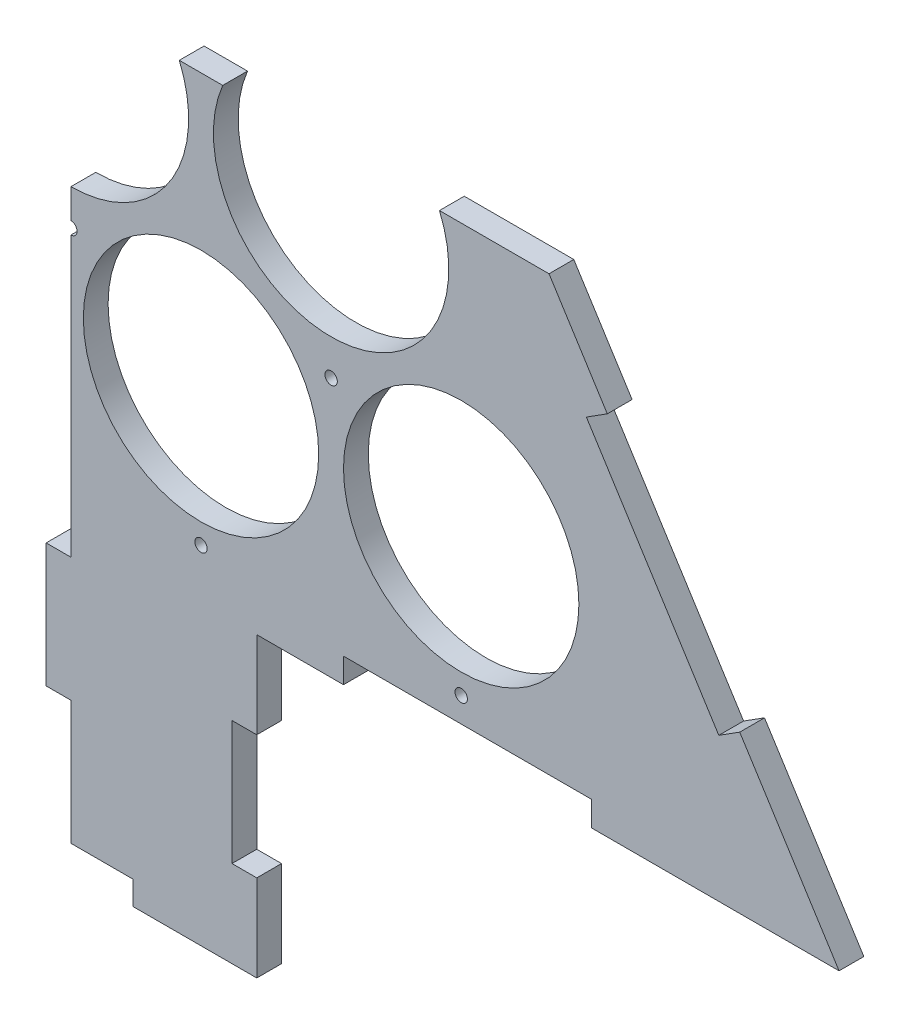
ISO-10303-21;
HEADER;
FILE_DESCRIPTION(('STEP AP214'),'2;1');
FILE_NAME('part.step','',(''),(''),'','','');
FILE_SCHEMA(('AUTOMOTIVE_DESIGN { 1 0 10303 214 1 1 1 1 }'));
ENDSEC;
DATA;
#1=APPLICATION_CONTEXT('core data for automotive mechanical design processes');
#2=APPLICATION_PROTOCOL_DEFINITION('international standard','automotive_design',2000,#1);
#3=PRODUCT_CONTEXT('',#1,'mechanical');
#4=PRODUCT('Part','Part','',(#3));
#5=PRODUCT_RELATED_PRODUCT_CATEGORY('part','',(#4));
#6=PRODUCT_DEFINITION_FORMATION('','',#4);
#7=PRODUCT_DEFINITION_CONTEXT('part definition',#1,'design');
#8=PRODUCT_DEFINITION('design','',#6,#7);
#9=PRODUCT_DEFINITION_SHAPE('','',#8);
#10=(LENGTH_UNIT() NAMED_UNIT(*) SI_UNIT(.MILLI.,.METRE.));
#11=(NAMED_UNIT(*) PLANE_ANGLE_UNIT() SI_UNIT($,.RADIAN.));
#12=(NAMED_UNIT(*) SI_UNIT($,.STERADIAN.) SOLID_ANGLE_UNIT());
#13=UNCERTAINTY_MEASURE_WITH_UNIT(LENGTH_MEASURE(1.E-05),#10,'distance_accuracy_value','');
#14=(GEOMETRIC_REPRESENTATION_CONTEXT(3) GLOBAL_UNCERTAINTY_ASSIGNED_CONTEXT((#13)) GLOBAL_UNIT_ASSIGNED_CONTEXT((#10,
#11,#12)) REPRESENTATION_CONTEXT('',''));
#15=CARTESIAN_POINT('',(0.,0.,0.));
#16=DIRECTION('',(0.,0.,1.));
#17=DIRECTION('',(1.,0.,0.));
#18=AXIS2_PLACEMENT_3D('',#15,#16,#17);
#19=CARTESIAN_POINT('',(0.,-217.34682851547,0.));
#20=DIRECTION('',(1.,0.,0.));
#21=DIRECTION('',(0.,1.,0.));
#22=AXIS2_PLACEMENT_3D('',#19,#20,#21);
#23=PLANE('',#22);
#24=DIRECTION('',(0.,1.,0.));
#25=VECTOR('',#24,1.);
#26=CARTESIAN_POINT('',(0.,-217.34682851547,10.));
#27=LINE('',#26,#25);
#28=CARTESIAN_POINT('',(0.,-186.072058661398,10.));
#29=VERTEX_POINT('',#28);
#30=CARTESIAN_POINT('',(0.,-136.072058661398,10.));
#31=VERTEX_POINT('',#30);
#32=EDGE_CURVE('E49',#29,#31,#27,.T.);
#33=ORIENTED_EDGE('',*,*,#32,.T.);
#34=DIRECTION('',(0.,0.,1.));
#35=VECTOR('',#34,1.);
#36=CARTESIAN_POINT('',(0.,-136.072058661398,0.));
#37=LINE('',#36,#35);
#38=CARTESIAN_POINT('',(0.,-136.072058661398,0.));
#39=VERTEX_POINT('',#38);
#40=EDGE_CURVE('E259',#39,#31,#37,.T.);
#41=ORIENTED_EDGE('',*,*,#40,.F.);
#42=DIRECTION('',(0.,1.,0.));
#43=VECTOR('',#42,1.);
#44=CARTESIAN_POINT('',(0.,-217.34682851547,0.));
#45=LINE('',#44,#43);
#46=CARTESIAN_POINT('',(0.,-186.072058661398,0.));
#47=VERTEX_POINT('',#46);
#48=EDGE_CURVE('E268',#47,#39,#45,.T.);
#49=ORIENTED_EDGE('',*,*,#48,.F.);
#50=DIRECTION('',(0.,0.,-1.));
#51=VECTOR('',#50,1.);
#52=CARTESIAN_POINT('',(0.,-186.072058661398,0.));
#53=LINE('',#52,#51);
#54=EDGE_CURVE('E467',#29,#47,#53,.T.);
#55=ORIENTED_EDGE('',*,*,#54,.F.);
#56=EDGE_LOOP('',(#33,#41,#49,#55));
#57=FACE_BOUND('',#56,.T.);
#58=ADVANCED_FACE('F34',(#57),#23,.F.);
#59=CARTESIAN_POINT('',(75.,-75.6428590162172,0.));
#60=DIRECTION('',(1.,0.,0.));
#61=DIRECTION('',(0.,0.,-1.));
#62=AXIS2_PLACEMENT_3D('',#59,#60,#61);
#63=PLANE('',#62);
#64=DIRECTION('',(0.,0.,1.));
#65=VECTOR('',#64,1.);
#66=CARTESIAN_POINT('',(75.,-160.642859016217,0.));
#67=LINE('',#66,#65);
#68=CARTESIAN_POINT('',(75.,-160.642859016217,0.));
#69=VERTEX_POINT('',#68);
#70=CARTESIAN_POINT('',(75.,-160.642859016217,10.));
#71=VERTEX_POINT('',#70);
#72=EDGE_CURVE('E301',#69,#71,#67,.T.);
#73=ORIENTED_EDGE('',*,*,#72,.T.);
#74=DIRECTION('',(0.,1.,0.));
#75=VECTOR('',#74,1.);
#76=CARTESIAN_POINT('',(75.,-75.6428590162172,10.));
#77=LINE('',#76,#75);
#78=CARTESIAN_POINT('',(75.,-195.642859016217,10.));
#79=VERTEX_POINT('',#78);
#80=EDGE_CURVE('E335',#79,#71,#77,.T.);
#81=ORIENTED_EDGE('',*,*,#80,.F.);
#82=DIRECTION('',(0.,0.,1.));
#83=VECTOR('',#82,1.);
#84=CARTESIAN_POINT('',(75.,-195.642859016217,0.));
#85=LINE('',#84,#83);
#86=CARTESIAN_POINT('',(75.,-195.642859016217,0.));
#87=VERTEX_POINT('',#86);
#88=EDGE_CURVE('E339',#87,#79,#85,.T.);
#89=ORIENTED_EDGE('',*,*,#88,.F.);
#90=DIRECTION('',(0.,1.,0.));
#91=VECTOR('',#90,1.);
#92=CARTESIAN_POINT('',(75.,-75.6428590162172,0.));
#93=LINE('',#92,#91);
#94=EDGE_CURVE('E336',#87,#69,#93,.T.);
#95=ORIENTED_EDGE('',*,*,#94,.T.);
#96=EDGE_LOOP('',(#73,#81,#89,#95));
#97=FACE_BOUND('',#96,.T.);
#98=ADVANCED_FACE('F518',(#97),#63,.T.);
#99=CARTESIAN_POINT('',(310.,-75.6428590162171,10.));
#100=DIRECTION('',(0.,1.,0.));
#101=DIRECTION('',(-1.,0.,0.));
#102=AXIS2_PLACEMENT_3D('',#99,#100,#101);
#103=PLANE('',#102);
#104=DIRECTION('',(1.,0.,0.));
#105=VECTOR('',#104,1.);
#106=CARTESIAN_POINT('',(310.,-75.6428590162171,10.));
#107=LINE('',#106,#105);
#108=CARTESIAN_POINT('',(210.,-75.6428590162169,10.));
#109=VERTEX_POINT('',#108);
#110=CARTESIAN_POINT('',(310.,-75.6428590162171,10.));
#111=VERTEX_POINT('',#110);
#112=EDGE_CURVE('E454',#109,#111,#107,.T.);
#113=ORIENTED_EDGE('',*,*,#112,.F.);
#114=DIRECTION('',(0.,0.,1.));
#115=VECTOR('',#114,1.);
#116=CARTESIAN_POINT('',(210.,-75.6428590162169,0.));
#117=LINE('',#116,#115);
#118=CARTESIAN_POINT('',(210.,-75.6428590162169,0.));
#119=VERTEX_POINT('',#118);
#120=EDGE_CURVE('E418',#119,#109,#117,.T.);
#121=ORIENTED_EDGE('',*,*,#120,.F.);
#122=DIRECTION('',(1.,0.,0.));
#123=VECTOR('',#122,1.);
#124=CARTESIAN_POINT('',(310.,-75.6428590162171,0.));
#125=LINE('',#124,#123);
#126=CARTESIAN_POINT('',(310.,-75.6428590162171,0.));
#127=VERTEX_POINT('',#126);
#128=EDGE_CURVE('E448',#119,#127,#125,.T.);
#129=ORIENTED_EDGE('',*,*,#128,.T.);
#130=DIRECTION('',(0.,0.,-1.));
#131=VECTOR('',#130,1.);
#132=CARTESIAN_POINT('',(310.,-75.6428590162171,10.));
#133=LINE('',#132,#131);
#134=EDGE_CURVE('E458',#111,#127,#133,.T.);
#135=ORIENTED_EDGE('',*,*,#134,.F.);
#136=EDGE_LOOP('',(#113,#121,#129,#135));
#137=FACE_BOUND('',#136,.T.);
#138=ADVANCED_FACE('F555',(#137),#103,.F.);
#139=CARTESIAN_POINT('',(0.,414.561180134828,10.));
#140=DIRECTION('',(-0.84517937784663,-0.53448275862069,0.));
#141=DIRECTION('',(0.53448275862069,-0.84517937784663,0.));
#142=AXIS2_PLACEMENT_3D('',#139,#140,#141);
#143=PLANE('',#142);
#144=DIRECTION('',(-0.53448275862069,0.845179377846631,0.));
#145=VECTOR('',#144,1.);
#146=CARTESIAN_POINT('',(0.,414.561180134828,0.));
#147=LINE('',#146,#145);
#148=CARTESIAN_POINT('',(269.913793103448,-12.2544056777199,0.));
#149=VERTEX_POINT('',#148);
#150=EDGE_CURVE('E462',#127,#149,#147,.T.);
#151=ORIENTED_EDGE('',*,*,#150,.T.);
#152=DIRECTION('',(0.,0.,1.));
#153=VECTOR('',#152,1.);
#154=CARTESIAN_POINT('',(269.913793103448,-12.2544056777199,0.));
#155=LINE('',#154,#153);
#156=CARTESIAN_POINT('',(269.913793103448,-12.2544056777199,10.));
#157=VERTEX_POINT('',#156);
#158=EDGE_CURVE('E391',#149,#157,#155,.T.);
#159=ORIENTED_EDGE('',*,*,#158,.T.);
#160=DIRECTION('',(-0.53448275862069,0.845179377846631,0.));
#161=VECTOR('',#160,1.);
#162=CARTESIAN_POINT('',(0.,414.561180134828,10.));
#163=LINE('',#162,#161);
#164=EDGE_CURVE('E455',#111,#157,#163,.T.);
#165=ORIENTED_EDGE('',*,*,#164,.F.);
#166=ORIENTED_EDGE('',*,*,#134,.T.);
#167=EDGE_LOOP('',(#151,#159,#165,#166));
#168=FACE_BOUND('',#167,.T.);
#169=ADVANCED_FACE('F559',(#168),#143,.F.);
#170=CARTESIAN_POINT('',(216.465517241379,72.2635321069432,0.));
#171=VERTEX_POINT('',#170);
#172=CARTESIAN_POINT('',(192.942106645631,109.461180134828,0.));
#173=VERTEX_POINT('',#172);
#174=EDGE_CURVE('E461',#171,#173,#147,.T.);
#175=ORIENTED_EDGE('',*,*,#174,.T.);
#176=DIRECTION('',(0.,0.,1.));
#177=VECTOR('',#176,1.);
#178=CARTESIAN_POINT('',(192.942106645631,109.461180134828,10.));
#179=LINE('',#178,#177);
#180=CARTESIAN_POINT('',(192.942106645631,109.461180134828,10.));
#181=VERTEX_POINT('',#180);
#182=EDGE_CURVE('E286',#173,#181,#179,.T.);
#183=ORIENTED_EDGE('',*,*,#182,.T.);
#184=CARTESIAN_POINT('',(216.465517241379,72.2635321069432,10.));
#185=VERTEX_POINT('',#184);
#186=EDGE_CURVE('E453',#185,#181,#163,.T.);
#187=ORIENTED_EDGE('',*,*,#186,.F.);
#188=DIRECTION('',(0.,0.,1.));
#189=VECTOR('',#188,1.);
#190=CARTESIAN_POINT('',(216.465517241379,72.2635321069432,0.));
#191=LINE('',#190,#189);
#192=EDGE_CURVE('E384',#171,#185,#191,.T.);
#193=ORIENTED_EDGE('',*,*,#192,.F.);
#194=EDGE_LOOP('',(#175,#183,#187,#193));
#195=FACE_BOUND('',#194,.T.);
#196=ADVANCED_FACE('F573',(#195),#143,.F.);
#197=CARTESIAN_POINT('',(0.,0.,10.));
#198=DIRECTION('',(0.,0.,-1.));
#199=DIRECTION('',(-1.,0.,0.));
#200=AXIS2_PLACEMENT_3D('',#197,#198,#199);
#201=PLANE('',#200);
#202=CARTESIAN_POINT('',(157.5,-55.6428590162172,10.));
#203=DIRECTION('',(0.,0.,1.));
#204=DIRECTION('',(1.,0.,0.));
#205=AXIS2_PLACEMENT_3D('',#202,#203,#204);
#206=CIRCLE('',#205,2.5);
#207=CARTESIAN_POINT('',(160.,-55.6428590162172,10.));
#208=VERTEX_POINT('',#207);
#209=EDGE_CURVE('E359',#208,#208,#206,.T.);
#210=ORIENTED_EDGE('',*,*,#209,.F.);
#211=EDGE_LOOP('',(#210));
#212=FACE_BOUND('',#211,.T.);
#213=CARTESIAN_POINT('',(52.5,-55.6428590162172,10.));
#214=DIRECTION('',(0.,0.,1.));
#215=DIRECTION('',(1.,0.,0.));
#216=AXIS2_PLACEMENT_3D('',#213,#214,#215);
#217=CIRCLE('',#216,2.5);
#218=CARTESIAN_POINT('',(55.,-55.6428590162172,10.));
#219=VERTEX_POINT('',#218);
#220=EDGE_CURVE('E365',#219,#219,#217,.T.);
#221=ORIENTED_EDGE('',*,*,#220,.F.);
#222=EDGE_LOOP('',(#221));
#223=FACE_BOUND('',#222,.T.);
#224=CARTESIAN_POINT('',(105.,29.0473750965556,10.));
#225=DIRECTION('',(0.,0.,1.));
#226=DIRECTION('',(1.,0.,0.));
#227=AXIS2_PLACEMENT_3D('',#224,#225,#226);
#228=CIRCLE('',#227,2.49999999999999);
#229=CARTESIAN_POINT('',(107.5,29.0473750965556,10.));
#230=VERTEX_POINT('',#229);
#231=EDGE_CURVE('E347',#230,#230,#228,.T.);
#232=ORIENTED_EDGE('',*,*,#231,.F.);
#233=EDGE_LOOP('',(#232));
#234=FACE_BOUND('',#233,.T.);
#235=CARTESIAN_POINT('',(52.5,0.,10.));
#236=DIRECTION('',(0.,0.,1.));
#237=DIRECTION('',(1.,0.,0.));
#238=AXIS2_PLACEMENT_3D('',#235,#236,#237);
#239=CIRCLE('',#238,47.5);
#240=CARTESIAN_POINT('',(100.,0.,10.));
#241=VERTEX_POINT('',#240);
#242=EDGE_CURVE('E445',#241,#241,#239,.T.);
#243=ORIENTED_EDGE('',*,*,#242,.F.);
#244=EDGE_LOOP('',(#243));
#245=FACE_BOUND('',#244,.T.);
#246=CARTESIAN_POINT('',(157.5,0.,10.));
#247=DIRECTION('',(0.,0.,1.));
#248=DIRECTION('',(1.,0.,0.));
#249=AXIS2_PLACEMENT_3D('',#246,#247,#248);
#250=CIRCLE('',#249,47.5);
#251=CARTESIAN_POINT('',(205.,0.,10.));
#252=VERTEX_POINT('',#251);
#253=EDGE_CURVE('E439',#252,#252,#250,.T.);
#254=ORIENTED_EDGE('',*,*,#253,.F.);
#255=EDGE_LOOP('',(#254));
#256=FACE_BOUND('',#255,.T.);
#257=ORIENTED_EDGE('',*,*,#186,.T.);
#258=DIRECTION('',(1.,0.,0.));
#259=VECTOR('',#258,1.);
#260=CARTESIAN_POINT('',(0.,109.461180134828,10.));
#261=LINE('',#260,#259);
#262=CARTESIAN_POINT('',(148.737217741161,109.461180134828,10.));
#263=VERTEX_POINT('',#262);
#264=EDGE_CURVE('E274',#263,#181,#261,.T.);
#265=ORIENTED_EDGE('',*,*,#264,.F.);
#266=CARTESIAN_POINT('',(105.,90.932667397366,10.));
#267=DIRECTION('',(0.,0.,1.));
#268=DIRECTION('',(1.,0.,0.));
#269=AXIS2_PLACEMENT_3D('',#266,#267,#268);
#270=CIRCLE('',#269,47.5);
#271=CARTESIAN_POINT('',(61.2627822588393,109.461180134828,10.));
#272=VERTEX_POINT('',#271);
#273=EDGE_CURVE('E427',#272,#263,#270,.T.);
#274=ORIENTED_EDGE('',*,*,#273,.F.);
#275=CARTESIAN_POINT('',(43.7372177411607,109.461180134828,10.));
#276=VERTEX_POINT('',#275);
#277=EDGE_CURVE('E267',#276,#272,#261,.T.);
#278=ORIENTED_EDGE('',*,*,#277,.F.);
#279=CARTESIAN_POINT('',(0.,90.932667397366,10.));
#280=DIRECTION('',(0.,0.,1.));
#281=DIRECTION('',(1.,0.,0.));
#282=AXIS2_PLACEMENT_3D('',#279,#280,#281);
#283=CIRCLE('',#282,47.5);
#284=CARTESIAN_POINT('',(0.,43.432667397366,10.));
#285=VERTEX_POINT('',#284);
#286=EDGE_CURVE('E433',#285,#276,#283,.T.);
#287=ORIENTED_EDGE('',*,*,#286,.F.);
#288=CARTESIAN_POINT('',(0.,31.5473750965556,10.));
#289=VERTEX_POINT('',#288);
#290=EDGE_CURVE('E261',#289,#285,#27,.T.);
#291=ORIENTED_EDGE('',*,*,#290,.F.);
#292=CARTESIAN_POINT('',(0.,29.0473750965556,10.));
#293=DIRECTION('',(0.,0.,1.));
#294=DIRECTION('',(1.,0.,0.));
#295=AXIS2_PLACEMENT_3D('',#292,#293,#294);
#296=CIRCLE('',#295,2.49999999999999);
#297=CARTESIAN_POINT('',(0.,26.5473750965556,10.));
#298=VERTEX_POINT('',#297);
#299=EDGE_CURVE('E353',#298,#289,#296,.T.);
#300=ORIENTED_EDGE('',*,*,#299,.F.);
#301=CARTESIAN_POINT('',(0.,-86.072058661398,10.));
#302=VERTEX_POINT('',#301);
#303=EDGE_CURVE('E273',#302,#298,#27,.T.);
#304=ORIENTED_EDGE('',*,*,#303,.F.);
#305=DIRECTION('',(-1.,0.,0.));
#306=VECTOR('',#305,1.);
#307=CARTESIAN_POINT('',(0.,-86.072058661398,10.));
#308=LINE('',#307,#306);
#309=CARTESIAN_POINT('',(-10.,-86.072058661398,10.));
#310=VERTEX_POINT('',#309);
#311=EDGE_CURVE('E256',#302,#310,#308,.T.);
#312=ORIENTED_EDGE('',*,*,#311,.T.);
#313=DIRECTION('',(0.,-1.,0.));
#314=VECTOR('',#313,1.);
#315=CARTESIAN_POINT('',(-10.,-86.072058661398,10.));
#316=LINE('',#315,#314);
#317=CARTESIAN_POINT('',(-9.99999999999999,-136.072058661398,10.));
#318=VERTEX_POINT('',#317);
#319=EDGE_CURVE('E231',#310,#318,#316,.T.);
#320=ORIENTED_EDGE('',*,*,#319,.T.);
#321=DIRECTION('',(1.,0.,0.));
#322=VECTOR('',#321,1.);
#323=CARTESIAN_POINT('',(0.,-136.072058661398,10.));
#324=LINE('',#323,#322);
#325=EDGE_CURVE('E250',#318,#31,#324,.T.);
#326=ORIENTED_EDGE('',*,*,#325,.T.);
#327=ORIENTED_EDGE('',*,*,#32,.F.);
#328=DIRECTION('',(-1.,0.,0.));
#329=VECTOR('',#328,1.);
#330=CARTESIAN_POINT('',(-25.,-186.072058661398,10.));
#331=LINE('',#330,#329);
#332=CARTESIAN_POINT('',(25.,-186.072058661398,10.));
#333=VERTEX_POINT('',#332);
#334=EDGE_CURVE('E294',#333,#29,#331,.T.);
#335=ORIENTED_EDGE('',*,*,#334,.F.);
#336=DIRECTION('',(0.,1.,0.));
#337=VECTOR('',#336,1.);
#338=CARTESIAN_POINT('',(25.,-195.642859016217,10.));
#339=LINE('',#338,#337);
#340=CARTESIAN_POINT('',(25.,-195.642859016217,10.));
#341=VERTEX_POINT('',#340);
#342=EDGE_CURVE('E298',#341,#333,#339,.T.);
#343=ORIENTED_EDGE('',*,*,#342,.F.);
#344=DIRECTION('',(1.,0.,0.));
#345=VECTOR('',#344,1.);
#346=CARTESIAN_POINT('',(-75.,-195.642859016217,10.));
#347=LINE('',#346,#345);
#348=EDGE_CURVE('E306',#341,#79,#347,.T.);
#349=ORIENTED_EDGE('',*,*,#348,.T.);
#350=ORIENTED_EDGE('',*,*,#80,.T.);
#351=DIRECTION('',(1.,0.,0.));
#352=VECTOR('',#351,1.);
#353=CARTESIAN_POINT('',(75.,-160.642859016217,10.));
#354=LINE('',#353,#352);
#355=CARTESIAN_POINT('',(65.,-160.642859016217,10.));
#356=VERTEX_POINT('',#355);
#357=EDGE_CURVE('E312',#356,#71,#354,.T.);
#358=ORIENTED_EDGE('',*,*,#357,.F.);
#359=DIRECTION('',(0.,-1.,0.));
#360=VECTOR('',#359,1.);
#361=CARTESIAN_POINT('',(65.,-160.642859016217,10.));
#362=LINE('',#361,#360);
#363=CARTESIAN_POINT('',(65.,-110.642859016217,10.));
#364=VERTEX_POINT('',#363);
#365=EDGE_CURVE('E321',#364,#356,#362,.T.);
#366=ORIENTED_EDGE('',*,*,#365,.F.);
#367=DIRECTION('',(-1.,0.,0.));
#368=VECTOR('',#367,1.);
#369=CARTESIAN_POINT('',(75.,-110.642859016217,10.));
#370=LINE('',#369,#368);
#371=CARTESIAN_POINT('',(75.,-110.642859016217,10.));
#372=VERTEX_POINT('',#371);
#373=EDGE_CURVE('E289',#372,#364,#370,.T.);
#374=ORIENTED_EDGE('',*,*,#373,.F.);
#375=CARTESIAN_POINT('',(75.,-75.6428590162172,10.));
#376=VERTEX_POINT('',#375);
#377=EDGE_CURVE('E341',#372,#376,#77,.T.);
#378=ORIENTED_EDGE('',*,*,#377,.T.);
#379=CARTESIAN_POINT('',(110.,-75.6428590162172,10.));
#380=VERTEX_POINT('',#379);
#381=EDGE_CURVE('E451',#376,#380,#107,.T.);
#382=ORIENTED_EDGE('',*,*,#381,.T.);
#383=DIRECTION('',(0.,-1.,0.));
#384=VECTOR('',#383,1.);
#385=CARTESIAN_POINT('',(110.,-75.642859016217,10.));
#386=LINE('',#385,#384);
#387=CARTESIAN_POINT('',(110.,-65.642859016217,10.));
#388=VERTEX_POINT('',#387);
#389=EDGE_CURVE('E404',#388,#380,#386,.T.);
#390=ORIENTED_EDGE('',*,*,#389,.F.);
#391=DIRECTION('',(-1.,0.,0.));
#392=VECTOR('',#391,1.);
#393=CARTESIAN_POINT('',(210.,-65.6428590162169,10.));
#394=LINE('',#393,#392);
#395=CARTESIAN_POINT('',(210.,-65.6428590162169,10.));
#396=VERTEX_POINT('',#395);
#397=EDGE_CURVE('E413',#396,#388,#394,.T.);
#398=ORIENTED_EDGE('',*,*,#397,.F.);
#399=DIRECTION('',(0.,1.,0.));
#400=VECTOR('',#399,1.);
#401=CARTESIAN_POINT('',(210.,-75.6428590162169,10.));
#402=LINE('',#401,#400);
#403=EDGE_CURVE('E394',#109,#396,#402,.T.);
#404=ORIENTED_EDGE('',*,*,#403,.F.);
#405=ORIENTED_EDGE('',*,*,#112,.T.);
#406=ORIENTED_EDGE('',*,*,#164,.T.);
#407=DIRECTION('',(0.845179377846631,0.53448275862069,0.));
#408=VECTOR('',#407,1.);
#409=CARTESIAN_POINT('',(269.913793103448,-12.2544056777199,10.));
#410=LINE('',#409,#408);
#411=CARTESIAN_POINT('',(261.461999324982,-17.5992332639268,10.));
#412=VERTEX_POINT('',#411);
#413=EDGE_CURVE('E378',#412,#157,#410,.T.);
#414=ORIENTED_EDGE('',*,*,#413,.F.);
#415=DIRECTION('',(0.53448275862069,-0.845179377846631,0.));
#416=VECTOR('',#415,1.);
#417=CARTESIAN_POINT('',(261.461999324982,-17.5992332639268,10.));
#418=LINE('',#417,#416);
#419=CARTESIAN_POINT('',(208.013723462913,66.9187045207363,10.));
#420=VERTEX_POINT('',#419);
#421=EDGE_CURVE('E387',#420,#412,#418,.T.);
#422=ORIENTED_EDGE('',*,*,#421,.F.);
#423=DIRECTION('',(-0.845179377846631,-0.53448275862069,0.));
#424=VECTOR('',#423,1.);
#425=CARTESIAN_POINT('',(208.013723462913,66.9187045207363,10.));
#426=LINE('',#425,#424);
#427=EDGE_CURVE('E371',#185,#420,#426,.T.);
#428=ORIENTED_EDGE('',*,*,#427,.F.);
#429=EDGE_LOOP('',(#257,#265,#274,#278,#287,#291,#300,#304,#312,#320,#326,#327,#335,#343,#349,
#350,#358,#366,#374,#378,#382,#390,#398,#404,#405,#406,#414,#422,#428));
#430=FACE_BOUND('',#429,.T.);
#431=ADVANCED_FACE('F478',(#212,#223,#234,#245,#256,#430),#201,.F.);
#432=CARTESIAN_POINT('',(0.,0.,0.));
#433=DIRECTION('',(0.,0.,-1.));
#434=DIRECTION('',(-1.,0.,0.));
#435=AXIS2_PLACEMENT_3D('',#432,#433,#434);
#436=PLANE('',#435);
#437=DIRECTION('',(1.,0.,0.));
#438=VECTOR('',#437,1.);
#439=CARTESIAN_POINT('',(0.,109.461180134828,0.));
#440=LINE('',#439,#438);
#441=CARTESIAN_POINT('',(148.737217741161,109.461180134828,0.));
#442=VERTEX_POINT('',#441);
#443=EDGE_CURVE('E269',#442,#173,#440,.T.);
#444=ORIENTED_EDGE('',*,*,#443,.T.);
#445=ORIENTED_EDGE('',*,*,#174,.F.);
#446=DIRECTION('',(-0.845179377846631,-0.53448275862069,0.));
#447=VECTOR('',#446,1.);
#448=CARTESIAN_POINT('',(208.013723462913,66.9187045207363,0.));
#449=LINE('',#448,#447);
#450=CARTESIAN_POINT('',(208.013723462913,66.9187045207363,0.));
#451=VERTEX_POINT('',#450);
#452=EDGE_CURVE('E374',#171,#451,#449,.T.);
#453=ORIENTED_EDGE('',*,*,#452,.T.);
#454=DIRECTION('',(0.53448275862069,-0.845179377846631,0.));
#455=VECTOR('',#454,1.);
#456=CARTESIAN_POINT('',(261.461999324982,-17.5992332639268,0.));
#457=LINE('',#456,#455);
#458=CARTESIAN_POINT('',(261.461999324982,-17.5992332639268,0.));
#459=VERTEX_POINT('',#458);
#460=EDGE_CURVE('E377',#451,#459,#457,.T.);
#461=ORIENTED_EDGE('',*,*,#460,.T.);
#462=DIRECTION('',(0.845179377846631,0.53448275862069,0.));
#463=VECTOR('',#462,1.);
#464=CARTESIAN_POINT('',(269.913793103448,-12.2544056777199,0.));
#465=LINE('',#464,#463);
#466=EDGE_CURVE('E381',#459,#149,#465,.T.);
#467=ORIENTED_EDGE('',*,*,#466,.T.);
#468=ORIENTED_EDGE('',*,*,#150,.F.);
#469=ORIENTED_EDGE('',*,*,#128,.F.);
#470=DIRECTION('',(0.,1.,0.));
#471=VECTOR('',#470,1.);
#472=CARTESIAN_POINT('',(210.,-75.6428590162169,0.));
#473=LINE('',#472,#471);
#474=CARTESIAN_POINT('',(210.,-65.6428590162169,0.));
#475=VERTEX_POINT('',#474);
#476=EDGE_CURVE('E400',#119,#475,#473,.T.);
#477=ORIENTED_EDGE('',*,*,#476,.T.);
#478=DIRECTION('',(-1.,0.,0.));
#479=VECTOR('',#478,1.);
#480=CARTESIAN_POINT('',(210.,-65.6428590162169,0.));
#481=LINE('',#480,#479);
#482=CARTESIAN_POINT('',(110.,-65.642859016217,0.));
#483=VERTEX_POINT('',#482);
#484=EDGE_CURVE('E403',#475,#483,#481,.T.);
#485=ORIENTED_EDGE('',*,*,#484,.T.);
#486=DIRECTION('',(0.,-1.,0.));
#487=VECTOR('',#486,1.);
#488=CARTESIAN_POINT('',(110.,-75.642859016217,0.));
#489=LINE('',#488,#487);
#490=CARTESIAN_POINT('',(110.,-75.642859016217,0.));
#491=VERTEX_POINT('',#490);
#492=EDGE_CURVE('E407',#483,#491,#489,.T.);
#493=ORIENTED_EDGE('',*,*,#492,.T.);
#494=CARTESIAN_POINT('',(75.,-75.6428590162172,0.));
#495=VERTEX_POINT('',#494);
#496=EDGE_CURVE('E459',#495,#491,#125,.T.);
#497=ORIENTED_EDGE('',*,*,#496,.F.);
#498=CARTESIAN_POINT('',(75.,-110.642859016217,0.));
#499=VERTEX_POINT('',#498);
#500=EDGE_CURVE('E334',#499,#495,#93,.T.);
#501=ORIENTED_EDGE('',*,*,#500,.F.);
#502=DIRECTION('',(-1.,0.,0.));
#503=VECTOR('',#502,1.);
#504=CARTESIAN_POINT('',(75.,-110.642859016217,0.));
#505=LINE('',#504,#503);
#506=CARTESIAN_POINT('',(65.,-110.642859016217,0.));
#507=VERTEX_POINT('',#506);
#508=EDGE_CURVE('E308',#499,#507,#505,.T.);
#509=ORIENTED_EDGE('',*,*,#508,.T.);
#510=DIRECTION('',(0.,-1.,0.));
#511=VECTOR('',#510,1.);
#512=CARTESIAN_POINT('',(65.,-160.642859016217,0.));
#513=LINE('',#512,#511);
#514=CARTESIAN_POINT('',(65.,-160.642859016217,0.));
#515=VERTEX_POINT('',#514);
#516=EDGE_CURVE('E311',#507,#515,#513,.T.);
#517=ORIENTED_EDGE('',*,*,#516,.T.);
#518=DIRECTION('',(1.,0.,0.));
#519=VECTOR('',#518,1.);
#520=CARTESIAN_POINT('',(75.,-160.642859016217,0.));
#521=LINE('',#520,#519);
#522=EDGE_CURVE('E315',#515,#69,#521,.T.);
#523=ORIENTED_EDGE('',*,*,#522,.T.);
#524=ORIENTED_EDGE('',*,*,#94,.F.);
#525=DIRECTION('',(1.,0.,0.));
#526=VECTOR('',#525,1.);
#527=CARTESIAN_POINT('',(-75.,-195.642859016217,0.));
#528=LINE('',#527,#526);
#529=CARTESIAN_POINT('',(25.,-195.642859016217,0.));
#530=VERTEX_POINT('',#529);
#531=EDGE_CURVE('E332',#530,#87,#528,.T.);
#532=ORIENTED_EDGE('',*,*,#531,.F.);
#533=DIRECTION('',(0.,1.,0.));
#534=VECTOR('',#533,1.);
#535=CARTESIAN_POINT('',(25.,-195.642859016217,0.));
#536=LINE('',#535,#534);
#537=CARTESIAN_POINT('',(25.,-186.072058661398,0.));
#538=VERTEX_POINT('',#537);
#539=EDGE_CURVE('E290',#530,#538,#536,.T.);
#540=ORIENTED_EDGE('',*,*,#539,.T.);
#541=DIRECTION('',(-1.,0.,0.));
#542=VECTOR('',#541,1.);
#543=CARTESIAN_POINT('',(-25.,-186.072058661398,0.));
#544=LINE('',#543,#542);
#545=EDGE_CURVE('E293',#538,#47,#544,.T.);
#546=ORIENTED_EDGE('',*,*,#545,.T.);
#547=ORIENTED_EDGE('',*,*,#48,.T.);
#548=DIRECTION('',(1.,0.,0.));
#549=VECTOR('',#548,1.);
#550=CARTESIAN_POINT('',(0.,-136.072058661398,0.));
#551=LINE('',#550,#549);
#552=CARTESIAN_POINT('',(-9.99999999999999,-136.072058661398,0.));
#553=VERTEX_POINT('',#552);
#554=EDGE_CURVE('E247',#553,#39,#551,.T.);
#555=ORIENTED_EDGE('',*,*,#554,.F.);
#556=DIRECTION('',(0.,-1.,0.));
#557=VECTOR('',#556,1.);
#558=CARTESIAN_POINT('',(-10.,-86.072058661398,0.));
#559=LINE('',#558,#557);
#560=CARTESIAN_POINT('',(-10.,-86.072058661398,0.));
#561=VERTEX_POINT('',#560);
#562=EDGE_CURVE('E228',#561,#553,#559,.T.);
#563=ORIENTED_EDGE('',*,*,#562,.F.);
#564=DIRECTION('',(-1.,0.,0.));
#565=VECTOR('',#564,1.);
#566=CARTESIAN_POINT('',(0.,-86.072058661398,0.));
#567=LINE('',#566,#565);
#568=CARTESIAN_POINT('',(0.,-86.072058661398,0.));
#569=VERTEX_POINT('',#568);
#570=EDGE_CURVE('E244',#569,#561,#567,.T.);
#571=ORIENTED_EDGE('',*,*,#570,.F.);
#572=CARTESIAN_POINT('',(0.,26.5473750965556,0.));
#573=VERTEX_POINT('',#572);
#574=EDGE_CURVE('E57',#569,#573,#45,.T.);
#575=ORIENTED_EDGE('',*,*,#574,.T.);
#576=CARTESIAN_POINT('',(0.,29.0473750965556,0.));
#577=DIRECTION('',(0.,0.,1.));
#578=DIRECTION('',(1.,0.,0.));
#579=AXIS2_PLACEMENT_3D('',#576,#577,#578);
#580=CIRCLE('',#579,2.49999999999999);
#581=CARTESIAN_POINT('',(0.,31.5473750965556,0.));
#582=VERTEX_POINT('',#581);
#583=EDGE_CURVE('E356',#573,#582,#580,.T.);
#584=ORIENTED_EDGE('',*,*,#583,.T.);
#585=CARTESIAN_POINT('',(0.,43.432667397366,0.));
#586=VERTEX_POINT('',#585);
#587=EDGE_CURVE('E264',#582,#586,#45,.T.);
#588=ORIENTED_EDGE('',*,*,#587,.T.);
#589=CARTESIAN_POINT('',(0.,90.932667397366,0.));
#590=DIRECTION('',(0.,0.,1.));
#591=DIRECTION('',(1.,0.,0.));
#592=AXIS2_PLACEMENT_3D('',#589,#590,#591);
#593=CIRCLE('',#592,47.5);
#594=CARTESIAN_POINT('',(43.7372177411607,109.461180134828,0.));
#595=VERTEX_POINT('',#594);
#596=EDGE_CURVE('E430',#586,#595,#593,.T.);
#597=ORIENTED_EDGE('',*,*,#596,.T.);
#598=CARTESIAN_POINT('',(61.2627822588393,109.461180134828,0.));
#599=VERTEX_POINT('',#598);
#600=EDGE_CURVE('E271',#595,#599,#440,.T.);
#601=ORIENTED_EDGE('',*,*,#600,.T.);
#602=CARTESIAN_POINT('',(105.,90.932667397366,0.));
#603=DIRECTION('',(0.,0.,1.));
#604=DIRECTION('',(1.,0.,0.));
#605=AXIS2_PLACEMENT_3D('',#602,#603,#604);
#606=CIRCLE('',#605,47.5);
#607=EDGE_CURVE('E420',#599,#442,#606,.T.);
#608=ORIENTED_EDGE('',*,*,#607,.T.);
#609=EDGE_LOOP('',(#444,#445,#453,#461,#467,#468,#469,#477,#485,#493,#497,#501,#509,#517,#523,
#524,#532,#540,#546,#547,#555,#563,#571,#575,#584,#588,#597,#601,#608));
#610=FACE_BOUND('',#609,.T.);
#611=CARTESIAN_POINT('',(157.5,-55.6428590162172,0.));
#612=DIRECTION('',(0.,0.,1.));
#613=DIRECTION('',(1.,0.,0.));
#614=AXIS2_PLACEMENT_3D('',#611,#612,#613);
#615=CIRCLE('',#614,2.5);
#616=CARTESIAN_POINT('',(160.,-55.6428590162172,0.));
#617=VERTEX_POINT('',#616);
#618=EDGE_CURVE('E362',#617,#617,#615,.T.);
#619=ORIENTED_EDGE('',*,*,#618,.T.);
#620=EDGE_LOOP('',(#619));
#621=FACE_BOUND('',#620,.T.);
#622=CARTESIAN_POINT('',(52.5,-55.6428590162172,0.));
#623=DIRECTION('',(0.,0.,1.));
#624=DIRECTION('',(1.,0.,0.));
#625=AXIS2_PLACEMENT_3D('',#622,#623,#624);
#626=CIRCLE('',#625,2.5);
#627=CARTESIAN_POINT('',(55.,-55.6428590162172,0.));
#628=VERTEX_POINT('',#627);
#629=EDGE_CURVE('E368',#628,#628,#626,.T.);
#630=ORIENTED_EDGE('',*,*,#629,.T.);
#631=EDGE_LOOP('',(#630));
#632=FACE_BOUND('',#631,.T.);
#633=CARTESIAN_POINT('',(105.,29.0473750965556,0.));
#634=DIRECTION('',(0.,0.,1.));
#635=DIRECTION('',(1.,0.,0.));
#636=AXIS2_PLACEMENT_3D('',#633,#634,#635);
#637=CIRCLE('',#636,2.49999999999999);
#638=CARTESIAN_POINT('',(107.5,29.0473750965556,0.));
#639=VERTEX_POINT('',#638);
#640=EDGE_CURVE('E350',#639,#639,#637,.T.);
#641=ORIENTED_EDGE('',*,*,#640,.T.);
#642=EDGE_LOOP('',(#641));
#643=FACE_BOUND('',#642,.T.);
#644=CARTESIAN_POINT('',(52.5,0.,0.));
#645=DIRECTION('',(0.,0.,1.));
#646=DIRECTION('',(1.,0.,0.));
#647=AXIS2_PLACEMENT_3D('',#644,#645,#646);
#648=CIRCLE('',#647,47.5);
#649=CARTESIAN_POINT('',(100.,0.,0.));
#650=VERTEX_POINT('',#649);
#651=EDGE_CURVE('E442',#650,#650,#648,.T.);
#652=ORIENTED_EDGE('',*,*,#651,.T.);
#653=EDGE_LOOP('',(#652));
#654=FACE_BOUND('',#653,.T.);
#655=CARTESIAN_POINT('',(157.5,0.,0.));
#656=DIRECTION('',(0.,0.,1.));
#657=DIRECTION('',(1.,0.,0.));
#658=AXIS2_PLACEMENT_3D('',#655,#656,#657);
#659=CIRCLE('',#658,47.5);
#660=CARTESIAN_POINT('',(205.,0.,0.));
#661=VERTEX_POINT('',#660);
#662=EDGE_CURVE('E436',#661,#661,#659,.T.);
#663=ORIENTED_EDGE('',*,*,#662,.T.);
#664=EDGE_LOOP('',(#663));
#665=FACE_BOUND('',#664,.T.);
#666=ADVANCED_FACE('F242',(#610,#621,#632,#643,#654,#665),#436,.T.);
#667=ORIENTED_EDGE('',*,*,#381,.F.);
#668=DIRECTION('',(0.,0.,1.));
#669=VECTOR('',#668,1.);
#670=CARTESIAN_POINT('',(75.,-75.6428590162172,0.));
#671=LINE('',#670,#669);
#672=EDGE_CURVE('E344',#495,#376,#671,.T.);
#673=ORIENTED_EDGE('',*,*,#672,.F.);
#674=ORIENTED_EDGE('',*,*,#496,.T.);
#675=DIRECTION('',(0.,0.,1.));
#676=VECTOR('',#675,1.);
#677=CARTESIAN_POINT('',(110.,-75.642859016217,0.));
#678=LINE('',#677,#676);
#679=EDGE_CURVE('E421',#491,#380,#678,.T.);
#680=ORIENTED_EDGE('',*,*,#679,.T.);
#681=EDGE_LOOP('',(#667,#673,#674,#680));
#682=FACE_BOUND('',#681,.T.);
#683=ADVANCED_FACE('F36',(#682),#103,.F.);
#684=CARTESIAN_POINT('',(52.5,0.,10.));
#685=DIRECTION('',(0.,0.,-1.));
#686=DIRECTION('',(-1.,0.,0.));
#687=AXIS2_PLACEMENT_3D('',#684,#685,#686);
#688=CYLINDRICAL_SURFACE('',#687,47.5);
#689=ORIENTED_EDGE('',*,*,#242,.T.);
#690=EDGE_LOOP('',(#689));
#691=FACE_BOUND('',#690,.T.);
#692=ORIENTED_EDGE('',*,*,#651,.F.);
#693=EDGE_LOOP('',(#692));
#694=FACE_BOUND('',#693,.T.);
#695=ADVANCED_FACE('F827',(#691,#694),#688,.F.);
#696=CARTESIAN_POINT('',(157.5,0.,10.));
#697=DIRECTION('',(0.,0.,-1.));
#698=DIRECTION('',(-1.,0.,0.));
#699=AXIS2_PLACEMENT_3D('',#696,#697,#698);
#700=CYLINDRICAL_SURFACE('',#699,47.5);
#701=ORIENTED_EDGE('',*,*,#253,.T.);
#702=EDGE_LOOP('',(#701));
#703=FACE_BOUND('',#702,.T.);
#704=ORIENTED_EDGE('',*,*,#662,.F.);
#705=EDGE_LOOP('',(#704));
#706=FACE_BOUND('',#705,.T.);
#707=ADVANCED_FACE('F822',(#703,#706),#700,.F.);
#708=CARTESIAN_POINT('',(0.,90.932667397366,10.));
#709=DIRECTION('',(0.,0.,-1.));
#710=DIRECTION('',(-1.,0.,0.));
#711=AXIS2_PLACEMENT_3D('',#708,#709,#710);
#712=CYLINDRICAL_SURFACE('',#711,47.5);
#713=DIRECTION('',(0.,0.,-1.));
#714=VECTOR('',#713,1.);
#715=CARTESIAN_POINT('',(43.7372177411607,109.461180134828,10.));
#716=LINE('',#715,#714);
#717=EDGE_CURVE('E284',#595,#276,#716,.F.);
#718=ORIENTED_EDGE('',*,*,#717,.F.);
#719=ORIENTED_EDGE('',*,*,#596,.F.);
#720=DIRECTION('',(0.,0.,-1.));
#721=VECTOR('',#720,1.);
#722=CARTESIAN_POINT('',(0.,43.432667397366,10.));
#723=LINE('',#722,#721);
#724=EDGE_CURVE('E282',#285,#586,#723,.T.);
#725=ORIENTED_EDGE('',*,*,#724,.F.);
#726=ORIENTED_EDGE('',*,*,#286,.T.);
#727=EDGE_LOOP('',(#718,#719,#725,#726));
#728=FACE_BOUND('',#727,.T.);
#729=ADVANCED_FACE('F491',(#728),#712,.F.);
#730=CARTESIAN_POINT('',(105.,90.932667397366,10.));
#731=DIRECTION('',(0.,0.,-1.));
#732=DIRECTION('',(-1.,0.,0.));
#733=AXIS2_PLACEMENT_3D('',#730,#731,#732);
#734=CYLINDRICAL_SURFACE('',#733,47.5);
#735=DIRECTION('',(0.,0.,-1.));
#736=VECTOR('',#735,1.);
#737=CARTESIAN_POINT('',(61.2627822588393,109.461180134828,10.));
#738=LINE('',#737,#736);
#739=EDGE_CURVE('E11',#272,#599,#738,.T.);
#740=ORIENTED_EDGE('',*,*,#739,.F.);
#741=ORIENTED_EDGE('',*,*,#273,.T.);
#742=DIRECTION('',(0.,0.,-1.));
#743=VECTOR('',#742,1.);
#744=CARTESIAN_POINT('',(148.737217741161,109.461180134828,10.));
#745=LINE('',#744,#743);
#746=EDGE_CURVE('E42',#442,#263,#745,.F.);
#747=ORIENTED_EDGE('',*,*,#746,.F.);
#748=ORIENTED_EDGE('',*,*,#607,.F.);
#749=EDGE_LOOP('',(#740,#741,#747,#748));
#750=FACE_BOUND('',#749,.T.);
#751=ADVANCED_FACE('F483',(#750),#734,.F.);
#752=CARTESIAN_POINT('',(269.913793103448,-12.2544056777199,0.));
#753=DIRECTION('',(0.53448275862069,-0.84517937784663,0.));
#754=DIRECTION('',(0.84517937784663,0.53448275862069,0.));
#755=AXIS2_PLACEMENT_3D('',#752,#753,#754);
#756=PLANE('',#755);
#757=ORIENTED_EDGE('',*,*,#413,.T.);
#758=ORIENTED_EDGE('',*,*,#158,.F.);
#759=ORIENTED_EDGE('',*,*,#466,.F.);
#760=DIRECTION('',(0.,0.,1.));
#761=VECTOR('',#760,1.);
#762=CARTESIAN_POINT('',(261.461999324982,-17.5992332639268,0.));
#763=LINE('',#762,#761);
#764=EDGE_CURVE('E395',#459,#412,#763,.T.);
#765=ORIENTED_EDGE('',*,*,#764,.T.);
#766=EDGE_LOOP('',(#757,#758,#759,#765));
#767=FACE_BOUND('',#766,.T.);
#768=ADVANCED_FACE('F563',(#767),#756,.F.);
#769=CARTESIAN_POINT('',(261.461999324982,-17.5992332639268,0.));
#770=DIRECTION('',(-0.84517937784663,-0.53448275862069,0.));
#771=DIRECTION('',(0.53448275862069,-0.84517937784663,0.));
#772=AXIS2_PLACEMENT_3D('',#769,#770,#771);
#773=PLANE('',#772);
#774=ORIENTED_EDGE('',*,*,#421,.T.);
#775=ORIENTED_EDGE('',*,*,#764,.F.);
#776=ORIENTED_EDGE('',*,*,#460,.F.);
#777=DIRECTION('',(0.,0.,1.));
#778=VECTOR('',#777,1.);
#779=CARTESIAN_POINT('',(208.013723462913,66.9187045207363,0.));
#780=LINE('',#779,#778);
#781=EDGE_CURVE('E397',#451,#420,#780,.T.);
#782=ORIENTED_EDGE('',*,*,#781,.T.);
#783=EDGE_LOOP('',(#774,#775,#776,#782));
#784=FACE_BOUND('',#783,.T.);
#785=ADVANCED_FACE('F567',(#784),#773,.F.);
#786=CARTESIAN_POINT('',(208.013723462913,66.9187045207363,0.));
#787=DIRECTION('',(-0.53448275862069,0.845179377846631,0.));
#788=DIRECTION('',(-0.845179377846631,-0.53448275862069,0.));
#789=AXIS2_PLACEMENT_3D('',#786,#787,#788);
#790=PLANE('',#789);
#791=ORIENTED_EDGE('',*,*,#427,.T.);
#792=ORIENTED_EDGE('',*,*,#781,.F.);
#793=ORIENTED_EDGE('',*,*,#452,.F.);
#794=ORIENTED_EDGE('',*,*,#192,.T.);
#795=EDGE_LOOP('',(#791,#792,#793,#794));
#796=FACE_BOUND('',#795,.T.);
#797=ADVANCED_FACE('F569',(#796),#790,.F.);
#798=CARTESIAN_POINT('',(210.,-75.6428590162169,0.));
#799=DIRECTION('',(1.,0.,0.));
#800=DIRECTION('',(0.,0.,-1.));
#801=AXIS2_PLACEMENT_3D('',#798,#799,#800);
#802=PLANE('',#801);
#803=ORIENTED_EDGE('',*,*,#403,.T.);
#804=DIRECTION('',(0.,0.,1.));
#805=VECTOR('',#804,1.);
#806=CARTESIAN_POINT('',(210.,-65.6428590162169,0.));
#807=LINE('',#806,#805);
#808=EDGE_CURVE('E410',#475,#396,#807,.T.);
#809=ORIENTED_EDGE('',*,*,#808,.F.);
#810=ORIENTED_EDGE('',*,*,#476,.F.);
#811=ORIENTED_EDGE('',*,*,#120,.T.);
#812=EDGE_LOOP('',(#803,#809,#810,#811));
#813=FACE_BOUND('',#812,.T.);
#814=ADVANCED_FACE('F575',(#813),#802,.F.);
#815=CARTESIAN_POINT('',(110.,-75.642859016217,0.));
#816=DIRECTION('',(-1.,0.,0.));
#817=DIRECTION('',(0.,-1.,0.));
#818=AXIS2_PLACEMENT_3D('',#815,#816,#817);
#819=PLANE('',#818);
#820=ORIENTED_EDGE('',*,*,#389,.T.);
#821=ORIENTED_EDGE('',*,*,#679,.F.);
#822=ORIENTED_EDGE('',*,*,#492,.F.);
#823=DIRECTION('',(0.,0.,1.));
#824=VECTOR('',#823,1.);
#825=CARTESIAN_POINT('',(110.,-65.642859016217,0.));
#826=LINE('',#825,#824);
#827=EDGE_CURVE('E424',#483,#388,#826,.T.);
#828=ORIENTED_EDGE('',*,*,#827,.T.);
#829=EDGE_LOOP('',(#820,#821,#822,#828));
#830=FACE_BOUND('',#829,.T.);
#831=ADVANCED_FACE('F543',(#830),#819,.F.);
#832=CARTESIAN_POINT('',(210.,-65.6428590162169,0.));
#833=DIRECTION('',(0.,1.,0.));
#834=DIRECTION('',(-1.,0.,0.));
#835=AXIS2_PLACEMENT_3D('',#832,#833,#834);
#836=PLANE('',#835);
#837=ORIENTED_EDGE('',*,*,#397,.T.);
#838=ORIENTED_EDGE('',*,*,#827,.F.);
#839=ORIENTED_EDGE('',*,*,#484,.F.);
#840=ORIENTED_EDGE('',*,*,#808,.T.);
#841=EDGE_LOOP('',(#837,#838,#839,#840));
#842=FACE_BOUND('',#841,.T.);
#843=ADVANCED_FACE('F547',(#842),#836,.F.);
#844=CARTESIAN_POINT('',(0.,29.0473750965556,0.));
#845=DIRECTION('',(0.,0.,1.));
#846=DIRECTION('',(1.,0.,0.));
#847=AXIS2_PLACEMENT_3D('',#844,#845,#846);
#848=CYLINDRICAL_SURFACE('',#847,2.49999999999999);
#849=ORIENTED_EDGE('',*,*,#299,.T.);
#850=DIRECTION('',(0.,0.,1.));
#851=VECTOR('',#850,1.);
#852=CARTESIAN_POINT('',(0.,31.5473750965556,0.));
#853=LINE('',#852,#851);
#854=EDGE_CURVE('E279',#289,#582,#853,.F.);
#855=ORIENTED_EDGE('',*,*,#854,.T.);
#856=ORIENTED_EDGE('',*,*,#583,.F.);
#857=DIRECTION('',(0.,0.,1.));
#858=VECTOR('',#857,1.);
#859=CARTESIAN_POINT('',(0.,26.5473750965556,0.));
#860=LINE('',#859,#858);
#861=EDGE_CURVE('E276',#573,#298,#860,.T.);
#862=ORIENTED_EDGE('',*,*,#861,.T.);
#863=EDGE_LOOP('',(#849,#855,#856,#862));
#864=FACE_BOUND('',#863,.T.);
#865=ADVANCED_FACE('F497',(#864),#848,.F.);
#866=CARTESIAN_POINT('',(105.,29.0473750965556,0.));
#867=DIRECTION('',(0.,0.,1.));
#868=DIRECTION('',(1.,0.,0.));
#869=AXIS2_PLACEMENT_3D('',#866,#867,#868);
#870=CYLINDRICAL_SURFACE('',#869,2.49999999999999);
#871=ORIENTED_EDGE('',*,*,#640,.F.);
#872=EDGE_LOOP('',(#871));
#873=FACE_BOUND('',#872,.T.);
#874=ORIENTED_EDGE('',*,*,#231,.T.);
#875=EDGE_LOOP('',(#874));
#876=FACE_BOUND('',#875,.T.);
#877=ADVANCED_FACE('F750',(#873,#876),#870,.F.);
#878=CARTESIAN_POINT('',(52.5,-55.6428590162172,0.));
#879=DIRECTION('',(0.,0.,1.));
#880=DIRECTION('',(1.,0.,0.));
#881=AXIS2_PLACEMENT_3D('',#878,#879,#880);
#882=CYLINDRICAL_SURFACE('',#881,2.5);
#883=ORIENTED_EDGE('',*,*,#629,.F.);
#884=EDGE_LOOP('',(#883));
#885=FACE_BOUND('',#884,.T.);
#886=ORIENTED_EDGE('',*,*,#220,.T.);
#887=EDGE_LOOP('',(#886));
#888=FACE_BOUND('',#887,.T.);
#889=ADVANCED_FACE('F743',(#885,#888),#882,.F.);
#890=CARTESIAN_POINT('',(157.5,-55.6428590162172,0.));
#891=DIRECTION('',(0.,0.,1.));
#892=DIRECTION('',(1.,0.,0.));
#893=AXIS2_PLACEMENT_3D('',#890,#891,#892);
#894=CYLINDRICAL_SURFACE('',#893,2.5);
#895=ORIENTED_EDGE('',*,*,#618,.F.);
#896=EDGE_LOOP('',(#895));
#897=FACE_BOUND('',#896,.T.);
#898=ORIENTED_EDGE('',*,*,#209,.T.);
#899=EDGE_LOOP('',(#898));
#900=FACE_BOUND('',#899,.T.);
#901=ADVANCED_FACE('F729',(#897,#900),#894,.F.);
#902=DIRECTION('',(0.,0.,1.));
#903=VECTOR('',#902,1.);
#904=CARTESIAN_POINT('',(75.,-110.642859016217,0.));
#905=LINE('',#904,#903);
#906=EDGE_CURVE('E318',#499,#372,#905,.T.);
#907=ORIENTED_EDGE('',*,*,#906,.F.);
#908=ORIENTED_EDGE('',*,*,#500,.T.);
#909=ORIENTED_EDGE('',*,*,#672,.T.);
#910=ORIENTED_EDGE('',*,*,#377,.F.);
#911=EDGE_LOOP('',(#907,#908,#909,#910));
#912=FACE_BOUND('',#911,.T.);
#913=ADVANCED_FACE('F533',(#912),#63,.T.);
#914=CARTESIAN_POINT('',(-75.,-195.642859016217,0.));
#915=DIRECTION('',(0.,-1.,0.));
#916=DIRECTION('',(1.,0.,0.));
#917=AXIS2_PLACEMENT_3D('',#914,#915,#916);
#918=PLANE('',#917);
#919=DIRECTION('',(0.,0.,1.));
#920=VECTOR('',#919,1.);
#921=CARTESIAN_POINT('',(25.,-195.642859016217,0.));
#922=LINE('',#921,#920);
#923=EDGE_CURVE('E297',#530,#341,#922,.T.);
#924=ORIENTED_EDGE('',*,*,#923,.F.);
#925=ORIENTED_EDGE('',*,*,#531,.T.);
#926=ORIENTED_EDGE('',*,*,#88,.T.);
#927=ORIENTED_EDGE('',*,*,#348,.F.);
#928=EDGE_LOOP('',(#924,#925,#926,#927));
#929=FACE_BOUND('',#928,.T.);
#930=ADVANCED_FACE('F513',(#929),#918,.T.);
#931=CARTESIAN_POINT('',(-25.,-186.072058661398,0.));
#932=DIRECTION('',(0.,1.,0.));
#933=DIRECTION('',(0.,0.,1.));
#934=AXIS2_PLACEMENT_3D('',#931,#932,#933);
#935=PLANE('',#934);
#936=ORIENTED_EDGE('',*,*,#334,.T.);
#937=ORIENTED_EDGE('',*,*,#54,.T.);
#938=ORIENTED_EDGE('',*,*,#545,.F.);
#939=DIRECTION('',(0.,0.,1.));
#940=VECTOR('',#939,1.);
#941=CARTESIAN_POINT('',(25.,-186.072058661398,0.));
#942=LINE('',#941,#940);
#943=EDGE_CURVE('E304',#538,#333,#942,.T.);
#944=ORIENTED_EDGE('',*,*,#943,.T.);
#945=EDGE_LOOP('',(#936,#937,#938,#944));
#946=FACE_BOUND('',#945,.T.);
#947=ADVANCED_FACE('F506',(#946),#935,.F.);
#948=CARTESIAN_POINT('',(25.,-195.642859016217,0.));
#949=DIRECTION('',(1.,0.,0.));
#950=DIRECTION('',(0.,0.,-1.));
#951=AXIS2_PLACEMENT_3D('',#948,#949,#950);
#952=PLANE('',#951);
#953=ORIENTED_EDGE('',*,*,#342,.T.);
#954=ORIENTED_EDGE('',*,*,#943,.F.);
#955=ORIENTED_EDGE('',*,*,#539,.F.);
#956=ORIENTED_EDGE('',*,*,#923,.T.);
#957=EDGE_LOOP('',(#953,#954,#955,#956));
#958=FACE_BOUND('',#957,.T.);
#959=ADVANCED_FACE('F697',(#958),#952,.F.);
#960=CARTESIAN_POINT('',(75.,-160.642859016217,0.));
#961=DIRECTION('',(0.,-1.,0.));
#962=DIRECTION('',(0.,0.,-1.));
#963=AXIS2_PLACEMENT_3D('',#960,#961,#962);
#964=PLANE('',#963);
#965=ORIENTED_EDGE('',*,*,#357,.T.);
#966=ORIENTED_EDGE('',*,*,#72,.F.);
#967=ORIENTED_EDGE('',*,*,#522,.F.);
#968=DIRECTION('',(0.,0.,1.));
#969=VECTOR('',#968,1.);
#970=CARTESIAN_POINT('',(65.,-160.642859016217,0.));
#971=LINE('',#970,#969);
#972=EDGE_CURVE('E327',#515,#356,#971,.T.);
#973=ORIENTED_EDGE('',*,*,#972,.T.);
#974=EDGE_LOOP('',(#965,#966,#967,#973));
#975=FACE_BOUND('',#974,.T.);
#976=ADVANCED_FACE('F523',(#975),#964,.F.);
#977=CARTESIAN_POINT('',(65.,-160.642859016217,0.));
#978=DIRECTION('',(-1.,0.,0.));
#979=DIRECTION('',(0.,-1.,0.));
#980=AXIS2_PLACEMENT_3D('',#977,#978,#979);
#981=PLANE('',#980);
#982=ORIENTED_EDGE('',*,*,#365,.T.);
#983=ORIENTED_EDGE('',*,*,#972,.F.);
#984=ORIENTED_EDGE('',*,*,#516,.F.);
#985=DIRECTION('',(0.,0.,1.));
#986=VECTOR('',#985,1.);
#987=CARTESIAN_POINT('',(65.,-110.642859016217,0.));
#988=LINE('',#987,#986);
#989=EDGE_CURVE('E329',#507,#364,#988,.T.);
#990=ORIENTED_EDGE('',*,*,#989,.T.);
#991=EDGE_LOOP('',(#982,#983,#984,#990));
#992=FACE_BOUND('',#991,.T.);
#993=ADVANCED_FACE('F527',(#992),#981,.F.);
#994=CARTESIAN_POINT('',(75.,-110.642859016217,0.));
#995=DIRECTION('',(0.,1.,0.));
#996=DIRECTION('',(0.,0.,1.));
#997=AXIS2_PLACEMENT_3D('',#994,#995,#996);
#998=PLANE('',#997);
#999=ORIENTED_EDGE('',*,*,#373,.T.);
#1000=ORIENTED_EDGE('',*,*,#989,.F.);
#1001=ORIENTED_EDGE('',*,*,#508,.F.);
#1002=ORIENTED_EDGE('',*,*,#906,.T.);
#1003=EDGE_LOOP('',(#999,#1000,#1001,#1002));
#1004=FACE_BOUND('',#1003,.T.);
#1005=ADVANCED_FACE('F529',(#1004),#998,.F.);
#1006=ORIENTED_EDGE('',*,*,#574,.F.);
#1007=DIRECTION('',(0.,0.,1.));
#1008=VECTOR('',#1007,1.);
#1009=CARTESIAN_POINT('',(0.,-86.072058661398,0.));
#1010=LINE('',#1009,#1008);
#1011=EDGE_CURVE('E237',#569,#302,#1010,.T.);
#1012=ORIENTED_EDGE('',*,*,#1011,.T.);
#1013=ORIENTED_EDGE('',*,*,#303,.T.);
#1014=ORIENTED_EDGE('',*,*,#861,.F.);
#1015=EDGE_LOOP('',(#1006,#1012,#1013,#1014));
#1016=FACE_BOUND('',#1015,.T.);
#1017=ADVANCED_FACE('F499',(#1016),#23,.F.);
#1018=ORIENTED_EDGE('',*,*,#724,.T.);
#1019=ORIENTED_EDGE('',*,*,#587,.F.);
#1020=ORIENTED_EDGE('',*,*,#854,.F.);
#1021=ORIENTED_EDGE('',*,*,#290,.T.);
#1022=EDGE_LOOP('',(#1018,#1019,#1020,#1021));
#1023=FACE_BOUND('',#1022,.T.);
#1024=ADVANCED_FACE('F588',(#1023),#23,.F.);
#1025=CARTESIAN_POINT('',(0.,109.461180134828,0.));
#1026=DIRECTION('',(0.,-1.,0.));
#1027=DIRECTION('',(0.,0.,-1.));
#1028=AXIS2_PLACEMENT_3D('',#1025,#1026,#1027);
#1029=PLANE('',#1028);
#1030=ORIENTED_EDGE('',*,*,#443,.F.);
#1031=ORIENTED_EDGE('',*,*,#746,.T.);
#1032=ORIENTED_EDGE('',*,*,#264,.T.);
#1033=ORIENTED_EDGE('',*,*,#182,.F.);
#1034=EDGE_LOOP('',(#1030,#1031,#1032,#1033));
#1035=FACE_BOUND('',#1034,.T.);
#1036=ADVANCED_FACE('F472',(#1035),#1029,.F.);
#1037=ORIENTED_EDGE('',*,*,#717,.T.);
#1038=ORIENTED_EDGE('',*,*,#277,.T.);
#1039=ORIENTED_EDGE('',*,*,#739,.T.);
#1040=ORIENTED_EDGE('',*,*,#600,.F.);
#1041=EDGE_LOOP('',(#1037,#1038,#1039,#1040));
#1042=FACE_BOUND('',#1041,.T.);
#1043=ADVANCED_FACE('F486',(#1042),#1029,.F.);
#1044=CARTESIAN_POINT('',(0.,-136.072058661398,0.));
#1045=DIRECTION('',(0.,-1.,0.));
#1046=DIRECTION('',(0.,0.,-1.));
#1047=AXIS2_PLACEMENT_3D('',#1044,#1045,#1046);
#1048=PLANE('',#1047);
#1049=ORIENTED_EDGE('',*,*,#325,.F.);
#1050=DIRECTION('',(0.,0.,1.));
#1051=VECTOR('',#1050,1.);
#1052=CARTESIAN_POINT('',(-9.99999999999999,-136.072058661398,0.));
#1053=LINE('',#1052,#1051);
#1054=EDGE_CURVE('E236',#553,#318,#1053,.T.);
#1055=ORIENTED_EDGE('',*,*,#1054,.F.);
#1056=ORIENTED_EDGE('',*,*,#554,.T.);
#1057=ORIENTED_EDGE('',*,*,#40,.T.);
#1058=EDGE_LOOP('',(#1049,#1055,#1056,#1057));
#1059=FACE_BOUND('',#1058,.T.);
#1060=ADVANCED_FACE('F502',(#1059),#1048,.T.);
#1061=CARTESIAN_POINT('',(-10.,-86.072058661398,0.));
#1062=DIRECTION('',(-1.,0.,0.));
#1063=DIRECTION('',(0.,-1.,0.));
#1064=AXIS2_PLACEMENT_3D('',#1061,#1062,#1063);
#1065=PLANE('',#1064);
#1066=ORIENTED_EDGE('',*,*,#319,.F.);
#1067=DIRECTION('',(0.,0.,1.));
#1068=VECTOR('',#1067,1.);
#1069=CARTESIAN_POINT('',(-10.,-86.072058661398,0.));
#1070=LINE('',#1069,#1068);
#1071=EDGE_CURVE('E225',#561,#310,#1070,.T.);
#1072=ORIENTED_EDGE('',*,*,#1071,.F.);
#1073=ORIENTED_EDGE('',*,*,#562,.T.);
#1074=ORIENTED_EDGE('',*,*,#1054,.T.);
#1075=EDGE_LOOP('',(#1066,#1072,#1073,#1074));
#1076=FACE_BOUND('',#1075,.T.);
#1077=ADVANCED_FACE('F227',(#1076),#1065,.T.);
#1078=CARTESIAN_POINT('',(0.,-86.072058661398,0.));
#1079=DIRECTION('',(0.,1.,0.));
#1080=DIRECTION('',(0.,0.,1.));
#1081=AXIS2_PLACEMENT_3D('',#1078,#1079,#1080);
#1082=PLANE('',#1081);
#1083=ORIENTED_EDGE('',*,*,#311,.F.);
#1084=ORIENTED_EDGE('',*,*,#1011,.F.);
#1085=ORIENTED_EDGE('',*,*,#570,.T.);
#1086=ORIENTED_EDGE('',*,*,#1071,.T.);
#1087=EDGE_LOOP('',(#1083,#1084,#1085,#1086));
#1088=FACE_BOUND('',#1087,.T.);
#1089=ADVANCED_FACE('F249',(#1088),#1082,.T.);
#1090=CLOSED_SHELL('',(#58,#98,#138,#169,#196,#431,#666,#683,#695,#707,#729,#751,#768,#785,#797,
#814,#831,#843,#865,#877,#889,#901,#913,#930,#947,#959,#976,#993,#1005,#1017,#1024,#1036,#1043,
#1060,#1077,#1089));
#1091=MANIFOLD_SOLID_BREP('B2',#1090);
#1092=ADVANCED_BREP_SHAPE_REPRESENTATION('',(#18,#1091),#14);
#1093=SHAPE_DEFINITION_REPRESENTATION(#9,#1092);
ENDSEC;
END-ISO-10303-21;
